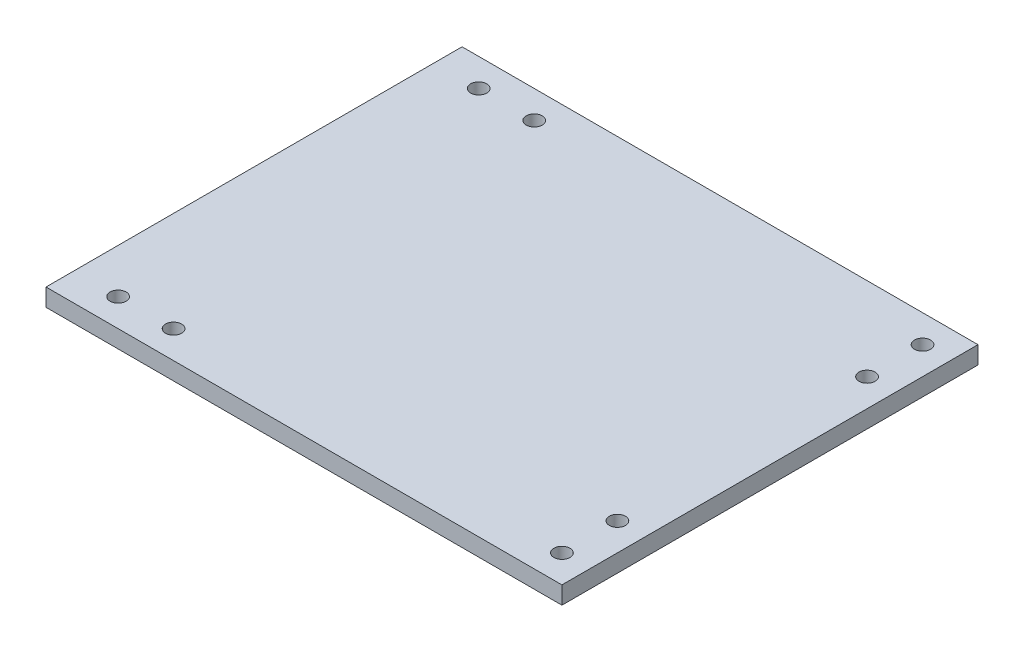
ISO-10303-21;
HEADER;
FILE_DESCRIPTION(('STEP AP214'),'2;1');
FILE_NAME('part.step','',(''),(''),'','','');
FILE_SCHEMA(('AUTOMOTIVE_DESIGN { 1 0 10303 214 1 1 1 1 }'));
ENDSEC;
DATA;
#1=APPLICATION_CONTEXT('core data for automotive mechanical design processes');
#2=APPLICATION_PROTOCOL_DEFINITION('international standard','automotive_design',2000,#1);
#3=PRODUCT_CONTEXT('',#1,'mechanical');
#4=PRODUCT('Part','Part','',(#3));
#5=PRODUCT_RELATED_PRODUCT_CATEGORY('part','',(#4));
#6=PRODUCT_DEFINITION_FORMATION('','',#4);
#7=PRODUCT_DEFINITION_CONTEXT('part definition',#1,'design');
#8=PRODUCT_DEFINITION('design','',#6,#7);
#9=PRODUCT_DEFINITION_SHAPE('','',#8);
#10=(LENGTH_UNIT() NAMED_UNIT(*) SI_UNIT(.MILLI.,.METRE.));
#11=(NAMED_UNIT(*) PLANE_ANGLE_UNIT() SI_UNIT($,.RADIAN.));
#12=(NAMED_UNIT(*) SI_UNIT($,.STERADIAN.) SOLID_ANGLE_UNIT());
#13=UNCERTAINTY_MEASURE_WITH_UNIT(LENGTH_MEASURE(1.E-05),#10,'distance_accuracy_value','');
#14=(GEOMETRIC_REPRESENTATION_CONTEXT(3) GLOBAL_UNCERTAINTY_ASSIGNED_CONTEXT((#13)) GLOBAL_UNIT_ASSIGNED_CONTEXT((#10,
#11,#12)) REPRESENTATION_CONTEXT('',''));
#15=CARTESIAN_POINT('',(0.,0.,0.));
#16=DIRECTION('',(0.,0.,1.));
#17=DIRECTION('',(1.,0.,0.));
#18=AXIS2_PLACEMENT_3D('',#15,#16,#17);
#19=CARTESIAN_POINT('',(-3.,3.175,0.));
#20=DIRECTION('',(0.,-1.,0.));
#21=DIRECTION('',(0.,0.,-1.));
#22=AXIS2_PLACEMENT_3D('',#19,#20,#21);
#23=PLANE('',#22);
#24=CARTESIAN_POINT('',(5.,3.175,32.5));
#25=DIRECTION('',(0.,1.,0.));
#26=DIRECTION('',(0.,0.,1.));
#27=AXIS2_PLACEMENT_3D('',#24,#25,#26);
#28=CIRCLE('',#27,1.45);
#29=CARTESIAN_POINT('',(5.,3.175,33.95));
#30=VERTEX_POINT('',#29);
#31=EDGE_CURVE('E108',#30,#30,#28,.T.);
#32=ORIENTED_EDGE('',*,*,#31,.F.);
#33=EDGE_LOOP('',(#32));
#34=FACE_BOUND('',#33,.T.);
#35=CARTESIAN_POINT('',(85.,3.175,32.5));
#36=DIRECTION('',(0.,1.,0.));
#37=DIRECTION('',(0.,0.,1.));
#38=AXIS2_PLACEMENT_3D('',#35,#36,#37);
#39=CIRCLE('',#38,1.45);
#40=CARTESIAN_POINT('',(85.,3.175,33.95));
#41=VERTEX_POINT('',#40);
#42=EDGE_CURVE('E80',#41,#41,#39,.T.);
#43=ORIENTED_EDGE('',*,*,#42,.F.);
#44=EDGE_LOOP('',(#43));
#45=FACE_BOUND('',#44,.T.);
#46=DIRECTION('',(0.,0.,1.));
#47=VECTOR('',#46,1.);
#48=CARTESIAN_POINT('',(-3.,3.175,37.5));
#49=LINE('',#48,#47);
#50=CARTESIAN_POINT('',(-3.,3.175,-37.5));
#51=VERTEX_POINT('',#50);
#52=CARTESIAN_POINT('',(-3.,3.175,37.5));
#53=VERTEX_POINT('',#52);
#54=EDGE_CURVE('E66',#51,#53,#49,.T.);
#55=ORIENTED_EDGE('',*,*,#54,.T.);
#56=DIRECTION('',(1.,0.,0.));
#57=VECTOR('',#56,1.);
#58=CARTESIAN_POINT('',(-3.,3.175,37.5));
#59=LINE('',#58,#57);
#60=CARTESIAN_POINT('',(90.,3.175,37.5));
#61=VERTEX_POINT('',#60);
#62=EDGE_CURVE('E48',#53,#61,#59,.T.);
#63=ORIENTED_EDGE('',*,*,#62,.T.);
#64=DIRECTION('',(0.,0.,-1.));
#65=VECTOR('',#64,1.);
#66=CARTESIAN_POINT('',(90.,3.175,37.5));
#67=LINE('',#66,#65);
#68=CARTESIAN_POINT('',(90.,3.175,-37.5));
#69=VERTEX_POINT('',#68);
#70=EDGE_CURVE('E127',#61,#69,#67,.T.);
#71=ORIENTED_EDGE('',*,*,#70,.T.);
#72=DIRECTION('',(1.,0.,0.));
#73=VECTOR('',#72,1.);
#74=CARTESIAN_POINT('',(-3.,3.175,-37.5));
#75=LINE('',#74,#73);
#76=EDGE_CURVE('E87',#51,#69,#75,.T.);
#77=ORIENTED_EDGE('',*,*,#76,.F.);
#78=EDGE_LOOP('',(#55,#63,#71,#77));
#79=FACE_BOUND('',#78,.T.);
#80=CARTESIAN_POINT('',(85.,3.175,22.5));
#81=DIRECTION('',(0.,1.,0.));
#82=DIRECTION('',(0.,0.,1.));
#83=AXIS2_PLACEMENT_3D('',#80,#81,#82);
#84=CIRCLE('',#83,1.45);
#85=CARTESIAN_POINT('',(85.,3.175,23.95));
#86=VERTEX_POINT('',#85);
#87=EDGE_CURVE('E114',#86,#86,#84,.T.);
#88=ORIENTED_EDGE('',*,*,#87,.F.);
#89=EDGE_LOOP('',(#88));
#90=FACE_BOUND('',#89,.T.);
#91=CARTESIAN_POINT('',(15.,3.175,32.5));
#92=DIRECTION('',(0.,1.,0.));
#93=DIRECTION('',(0.,0.,1.));
#94=AXIS2_PLACEMENT_3D('',#91,#92,#93);
#95=CIRCLE('',#94,1.45);
#96=CARTESIAN_POINT('',(15.,3.175,33.95));
#97=VERTEX_POINT('',#96);
#98=EDGE_CURVE('E102',#97,#97,#95,.T.);
#99=ORIENTED_EDGE('',*,*,#98,.F.);
#100=EDGE_LOOP('',(#99));
#101=FACE_BOUND('',#100,.T.);
#102=CARTESIAN_POINT('',(15.,3.175,-32.5));
#103=DIRECTION('',(0.,-1.,0.));
#104=DIRECTION('',(0.,0.,-1.));
#105=AXIS2_PLACEMENT_3D('',#102,#103,#104);
#106=CIRCLE('',#105,1.45);
#107=CARTESIAN_POINT('',(15.,3.175,-33.95));
#108=VERTEX_POINT('',#107);
#109=EDGE_CURVE('E147',#108,#108,#106,.T.);
#110=ORIENTED_EDGE('',*,*,#109,.T.);
#111=EDGE_LOOP('',(#110));
#112=FACE_BOUND('',#111,.T.);
#113=CARTESIAN_POINT('',(5.,3.175,-32.5));
#114=DIRECTION('',(0.,-1.,0.));
#115=DIRECTION('',(0.,0.,-1.));
#116=AXIS2_PLACEMENT_3D('',#113,#114,#115);
#117=CIRCLE('',#116,1.45);
#118=CARTESIAN_POINT('',(5.,3.175,-33.95));
#119=VERTEX_POINT('',#118);
#120=EDGE_CURVE('E151',#119,#119,#117,.T.);
#121=ORIENTED_EDGE('',*,*,#120,.T.);
#122=EDGE_LOOP('',(#121));
#123=FACE_BOUND('',#122,.T.);
#124=CARTESIAN_POINT('',(85.,3.175,-22.5));
#125=DIRECTION('',(0.,-1.,0.));
#126=DIRECTION('',(0.,0.,-1.));
#127=AXIS2_PLACEMENT_3D('',#124,#125,#126);
#128=CIRCLE('',#127,1.45);
#129=CARTESIAN_POINT('',(85.,3.175,-23.95));
#130=VERTEX_POINT('',#129);
#131=EDGE_CURVE('E155',#130,#130,#128,.T.);
#132=ORIENTED_EDGE('',*,*,#131,.T.);
#133=EDGE_LOOP('',(#132));
#134=FACE_BOUND('',#133,.T.);
#135=CARTESIAN_POINT('',(85.,3.175,-32.5));
#136=DIRECTION('',(0.,-1.,0.));
#137=DIRECTION('',(0.,0.,-1.));
#138=AXIS2_PLACEMENT_3D('',#135,#136,#137);
#139=CIRCLE('',#138,1.45);
#140=CARTESIAN_POINT('',(85.,3.175,-33.95));
#141=VERTEX_POINT('',#140);
#142=EDGE_CURVE('E92',#141,#141,#139,.T.);
#143=ORIENTED_EDGE('',*,*,#142,.T.);
#144=EDGE_LOOP('',(#143));
#145=FACE_BOUND('',#144,.T.);
#146=ADVANCED_FACE('F31',(#34,#45,#79,#90,#101,#112,#123,#134,#145),#23,.F.);
#147=CARTESIAN_POINT('',(-3.,0.,0.));
#148=DIRECTION('',(0.,-1.,0.));
#149=DIRECTION('',(0.,0.,-1.));
#150=AXIS2_PLACEMENT_3D('',#147,#148,#149);
#151=PLANE('',#150);
#152=CARTESIAN_POINT('',(5.,0.,32.5));
#153=DIRECTION('',(0.,1.,0.));
#154=DIRECTION('',(0.,0.,1.));
#155=AXIS2_PLACEMENT_3D('',#152,#153,#154);
#156=CIRCLE('',#155,1.45);
#157=CARTESIAN_POINT('',(5.,0.,33.95));
#158=VERTEX_POINT('',#157);
#159=EDGE_CURVE('E105',#158,#158,#156,.T.);
#160=ORIENTED_EDGE('',*,*,#159,.T.);
#161=EDGE_LOOP('',(#160));
#162=FACE_BOUND('',#161,.T.);
#163=CARTESIAN_POINT('',(85.,0.,32.5));
#164=DIRECTION('',(0.,1.,0.));
#165=DIRECTION('',(0.,0.,1.));
#166=AXIS2_PLACEMENT_3D('',#163,#164,#165);
#167=CIRCLE('',#166,1.45);
#168=CARTESIAN_POINT('',(85.,0.,33.95));
#169=VERTEX_POINT('',#168);
#170=EDGE_CURVE('E117',#169,#169,#167,.T.);
#171=ORIENTED_EDGE('',*,*,#170,.T.);
#172=EDGE_LOOP('',(#171));
#173=FACE_BOUND('',#172,.T.);
#174=DIRECTION('',(0.,0.,1.));
#175=VECTOR('',#174,1.);
#176=CARTESIAN_POINT('',(-3.,0.,37.5));
#177=LINE('',#176,#175);
#178=CARTESIAN_POINT('',(-3.,0.,-37.5));
#179=VERTEX_POINT('',#178);
#180=CARTESIAN_POINT('',(-3.,0.,37.5));
#181=VERTEX_POINT('',#180);
#182=EDGE_CURVE('E75',#179,#181,#177,.T.);
#183=ORIENTED_EDGE('',*,*,#182,.F.);
#184=DIRECTION('',(1.,0.,0.));
#185=VECTOR('',#184,1.);
#186=CARTESIAN_POINT('',(-3.,0.,-37.5));
#187=LINE('',#186,#185);
#188=CARTESIAN_POINT('',(90.,0.,-37.5));
#189=VERTEX_POINT('',#188);
#190=EDGE_CURVE('E79',#179,#189,#187,.T.);
#191=ORIENTED_EDGE('',*,*,#190,.T.);
#192=DIRECTION('',(0.,0.,-1.));
#193=VECTOR('',#192,1.);
#194=CARTESIAN_POINT('',(90.,0.,37.5));
#195=LINE('',#194,#193);
#196=CARTESIAN_POINT('',(90.,0.,37.5));
#197=VERTEX_POINT('',#196);
#198=EDGE_CURVE('E125',#197,#189,#195,.T.);
#199=ORIENTED_EDGE('',*,*,#198,.F.);
#200=DIRECTION('',(1.,0.,0.));
#201=VECTOR('',#200,1.);
#202=CARTESIAN_POINT('',(-3.,0.,37.5));
#203=LINE('',#202,#201);
#204=EDGE_CURVE('E59',#181,#197,#203,.T.);
#205=ORIENTED_EDGE('',*,*,#204,.F.);
#206=EDGE_LOOP('',(#183,#191,#199,#205));
#207=FACE_BOUND('',#206,.T.);
#208=CARTESIAN_POINT('',(85.,0.,22.5));
#209=DIRECTION('',(0.,1.,0.));
#210=DIRECTION('',(0.,0.,1.));
#211=AXIS2_PLACEMENT_3D('',#208,#209,#210);
#212=CIRCLE('',#211,1.45);
#213=CARTESIAN_POINT('',(85.,0.,23.95));
#214=VERTEX_POINT('',#213);
#215=EDGE_CURVE('E111',#214,#214,#212,.T.);
#216=ORIENTED_EDGE('',*,*,#215,.T.);
#217=EDGE_LOOP('',(#216));
#218=FACE_BOUND('',#217,.T.);
#219=CARTESIAN_POINT('',(15.,0.,32.5));
#220=DIRECTION('',(0.,1.,0.));
#221=DIRECTION('',(0.,0.,1.));
#222=AXIS2_PLACEMENT_3D('',#219,#220,#221);
#223=CIRCLE('',#222,1.45);
#224=CARTESIAN_POINT('',(15.,0.,33.95));
#225=VERTEX_POINT('',#224);
#226=EDGE_CURVE('E101',#225,#225,#223,.T.);
#227=ORIENTED_EDGE('',*,*,#226,.T.);
#228=EDGE_LOOP('',(#227));
#229=FACE_BOUND('',#228,.T.);
#230=CARTESIAN_POINT('',(15.,0.,-32.5));
#231=DIRECTION('',(0.,-1.,0.));
#232=DIRECTION('',(0.,0.,-1.));
#233=AXIS2_PLACEMENT_3D('',#230,#231,#232);
#234=CIRCLE('',#233,1.45);
#235=CARTESIAN_POINT('',(15.,0.,-33.95));
#236=VERTEX_POINT('',#235);
#237=EDGE_CURVE('E175',#236,#236,#234,.T.);
#238=ORIENTED_EDGE('',*,*,#237,.F.);
#239=EDGE_LOOP('',(#238));
#240=FACE_BOUND('',#239,.T.);
#241=CARTESIAN_POINT('',(5.,0.,-32.5));
#242=DIRECTION('',(0.,-1.,0.));
#243=DIRECTION('',(0.,0.,-1.));
#244=AXIS2_PLACEMENT_3D('',#241,#242,#243);
#245=CIRCLE('',#244,1.45);
#246=CARTESIAN_POINT('',(5.,0.,-33.95));
#247=VERTEX_POINT('',#246);
#248=EDGE_CURVE('E171',#247,#247,#245,.T.);
#249=ORIENTED_EDGE('',*,*,#248,.F.);
#250=EDGE_LOOP('',(#249));
#251=FACE_BOUND('',#250,.T.);
#252=CARTESIAN_POINT('',(85.,0.,-22.5));
#253=DIRECTION('',(0.,-1.,0.));
#254=DIRECTION('',(0.,0.,-1.));
#255=AXIS2_PLACEMENT_3D('',#252,#253,#254);
#256=CIRCLE('',#255,1.45);
#257=CARTESIAN_POINT('',(85.,0.,-23.95));
#258=VERTEX_POINT('',#257);
#259=EDGE_CURVE('E166',#258,#258,#256,.T.);
#260=ORIENTED_EDGE('',*,*,#259,.F.);
#261=EDGE_LOOP('',(#260));
#262=FACE_BOUND('',#261,.T.);
#263=CARTESIAN_POINT('',(85.,0.,-32.5));
#264=DIRECTION('',(0.,-1.,0.));
#265=DIRECTION('',(0.,0.,-1.));
#266=AXIS2_PLACEMENT_3D('',#263,#264,#265);
#267=CIRCLE('',#266,1.45);
#268=CARTESIAN_POINT('',(85.,0.,-33.95));
#269=VERTEX_POINT('',#268);
#270=EDGE_CURVE('E96',#269,#269,#267,.T.);
#271=ORIENTED_EDGE('',*,*,#270,.F.);
#272=EDGE_LOOP('',(#271));
#273=FACE_BOUND('',#272,.T.);
#274=ADVANCED_FACE('F76',(#162,#173,#207,#218,#229,#240,#251,#262,#273),#151,.T.);
#275=CARTESIAN_POINT('',(-3.,3.175,37.5));
#276=DIRECTION('',(1.,0.,0.));
#277=DIRECTION('',(0.,0.,-1.));
#278=AXIS2_PLACEMENT_3D('',#275,#276,#277);
#279=PLANE('',#278);
#280=ORIENTED_EDGE('',*,*,#182,.T.);
#281=DIRECTION('',(0.,-1.,0.));
#282=VECTOR('',#281,1.);
#283=CARTESIAN_POINT('',(-3.,3.175,37.5));
#284=LINE('',#283,#282);
#285=EDGE_CURVE('E11',#53,#181,#284,.T.);
#286=ORIENTED_EDGE('',*,*,#285,.F.);
#287=ORIENTED_EDGE('',*,*,#54,.F.);
#288=DIRECTION('',(0.,-1.,0.));
#289=VECTOR('',#288,1.);
#290=CARTESIAN_POINT('',(-3.,3.175,-37.5));
#291=LINE('',#290,#289);
#292=EDGE_CURVE('E82',#51,#179,#291,.T.);
#293=ORIENTED_EDGE('',*,*,#292,.T.);
#294=EDGE_LOOP('',(#280,#286,#287,#293));
#295=FACE_BOUND('',#294,.T.);
#296=ADVANCED_FACE('F33',(#295),#279,.F.);
#297=CARTESIAN_POINT('',(-3.,3.175,37.5));
#298=DIRECTION('',(0.,0.,-1.));
#299=DIRECTION('',(-1.,0.,0.));
#300=AXIS2_PLACEMENT_3D('',#297,#298,#299);
#301=PLANE('',#300);
#302=ORIENTED_EDGE('',*,*,#204,.T.);
#303=DIRECTION('',(0.,-1.,0.));
#304=VECTOR('',#303,1.);
#305=CARTESIAN_POINT('',(90.,3.175,37.5));
#306=LINE('',#305,#304);
#307=EDGE_CURVE('E40',#61,#197,#306,.T.);
#308=ORIENTED_EDGE('',*,*,#307,.F.);
#309=ORIENTED_EDGE('',*,*,#62,.F.);
#310=ORIENTED_EDGE('',*,*,#285,.T.);
#311=EDGE_LOOP('',(#302,#308,#309,#310));
#312=FACE_BOUND('',#311,.T.);
#313=ADVANCED_FACE('F135',(#312),#301,.F.);
#314=CARTESIAN_POINT('',(90.,3.175,37.5));
#315=DIRECTION('',(-1.,0.,0.));
#316=DIRECTION('',(0.,0.,1.));
#317=AXIS2_PLACEMENT_3D('',#314,#315,#316);
#318=PLANE('',#317);
#319=ORIENTED_EDGE('',*,*,#198,.T.);
#320=DIRECTION('',(0.,-1.,0.));
#321=VECTOR('',#320,1.);
#322=CARTESIAN_POINT('',(90.,3.175,-37.5));
#323=LINE('',#322,#321);
#324=EDGE_CURVE('E86',#69,#189,#323,.T.);
#325=ORIENTED_EDGE('',*,*,#324,.F.);
#326=ORIENTED_EDGE('',*,*,#70,.F.);
#327=ORIENTED_EDGE('',*,*,#307,.T.);
#328=EDGE_LOOP('',(#319,#325,#326,#327));
#329=FACE_BOUND('',#328,.T.);
#330=ADVANCED_FACE('F133',(#329),#318,.F.);
#331=CARTESIAN_POINT('',(85.,3.175,32.5));
#332=DIRECTION('',(0.,-1.,0.));
#333=DIRECTION('',(0.,0.,-1.));
#334=AXIS2_PLACEMENT_3D('',#331,#332,#333);
#335=CYLINDRICAL_SURFACE('',#334,1.45);
#336=ORIENTED_EDGE('',*,*,#42,.T.);
#337=EDGE_LOOP('',(#336));
#338=FACE_BOUND('',#337,.T.);
#339=ORIENTED_EDGE('',*,*,#170,.F.);
#340=EDGE_LOOP('',(#339));
#341=FACE_BOUND('',#340,.T.);
#342=ADVANCED_FACE('F214',(#338,#341),#335,.F.);
#343=CARTESIAN_POINT('',(85.,3.175,22.5));
#344=DIRECTION('',(0.,-1.,0.));
#345=DIRECTION('',(0.,0.,-1.));
#346=AXIS2_PLACEMENT_3D('',#343,#344,#345);
#347=CYLINDRICAL_SURFACE('',#346,1.45);
#348=ORIENTED_EDGE('',*,*,#87,.T.);
#349=EDGE_LOOP('',(#348));
#350=FACE_BOUND('',#349,.T.);
#351=ORIENTED_EDGE('',*,*,#215,.F.);
#352=EDGE_LOOP('',(#351));
#353=FACE_BOUND('',#352,.T.);
#354=ADVANCED_FACE('F210',(#350,#353),#347,.F.);
#355=CARTESIAN_POINT('',(5.,3.175,32.5));
#356=DIRECTION('',(0.,-1.,0.));
#357=DIRECTION('',(0.,0.,-1.));
#358=AXIS2_PLACEMENT_3D('',#355,#356,#357);
#359=CYLINDRICAL_SURFACE('',#358,1.45);
#360=ORIENTED_EDGE('',*,*,#31,.T.);
#361=EDGE_LOOP('',(#360));
#362=FACE_BOUND('',#361,.T.);
#363=ORIENTED_EDGE('',*,*,#159,.F.);
#364=EDGE_LOOP('',(#363));
#365=FACE_BOUND('',#364,.T.);
#366=ADVANCED_FACE('F206',(#362,#365),#359,.F.);
#367=CARTESIAN_POINT('',(15.,3.175,32.5));
#368=DIRECTION('',(0.,-1.,0.));
#369=DIRECTION('',(0.,0.,-1.));
#370=AXIS2_PLACEMENT_3D('',#367,#368,#369);
#371=CYLINDRICAL_SURFACE('',#370,1.45);
#372=ORIENTED_EDGE('',*,*,#98,.T.);
#373=EDGE_LOOP('',(#372));
#374=FACE_BOUND('',#373,.T.);
#375=ORIENTED_EDGE('',*,*,#226,.F.);
#376=EDGE_LOOP('',(#375));
#377=FACE_BOUND('',#376,.T.);
#378=ADVANCED_FACE('F203',(#374,#377),#371,.F.);
#379=CARTESIAN_POINT('',(-3.,3.175,-37.5));
#380=DIRECTION('',(0.,0.,-1.));
#381=DIRECTION('',(-1.,0.,0.));
#382=AXIS2_PLACEMENT_3D('',#379,#380,#381);
#383=PLANE('',#382);
#384=ORIENTED_EDGE('',*,*,#190,.F.);
#385=ORIENTED_EDGE('',*,*,#292,.F.);
#386=ORIENTED_EDGE('',*,*,#76,.T.);
#387=ORIENTED_EDGE('',*,*,#324,.T.);
#388=EDGE_LOOP('',(#384,#385,#386,#387));
#389=FACE_BOUND('',#388,.T.);
#390=ADVANCED_FACE('F90',(#389),#383,.T.);
#391=CARTESIAN_POINT('',(85.,3.175,-32.5));
#392=DIRECTION('',(0.,-1.,0.));
#393=DIRECTION('',(0.,0.,-1.));
#394=AXIS2_PLACEMENT_3D('',#391,#392,#393);
#395=CYLINDRICAL_SURFACE('',#394,1.45);
#396=ORIENTED_EDGE('',*,*,#142,.F.);
#397=EDGE_LOOP('',(#396));
#398=FACE_BOUND('',#397,.T.);
#399=ORIENTED_EDGE('',*,*,#270,.T.);
#400=EDGE_LOOP('',(#399));
#401=FACE_BOUND('',#400,.T.);
#402=ADVANCED_FACE('F158',(#398,#401),#395,.F.);
#403=CARTESIAN_POINT('',(85.,3.175,-22.5));
#404=DIRECTION('',(0.,-1.,0.));
#405=DIRECTION('',(0.,0.,-1.));
#406=AXIS2_PLACEMENT_3D('',#403,#404,#405);
#407=CYLINDRICAL_SURFACE('',#406,1.45);
#408=ORIENTED_EDGE('',*,*,#131,.F.);
#409=EDGE_LOOP('',(#408));
#410=FACE_BOUND('',#409,.T.);
#411=ORIENTED_EDGE('',*,*,#259,.T.);
#412=EDGE_LOOP('',(#411));
#413=FACE_BOUND('',#412,.T.);
#414=ADVANCED_FACE('F161',(#410,#413),#407,.F.);
#415=CARTESIAN_POINT('',(5.,3.175,-32.5));
#416=DIRECTION('',(0.,-1.,0.));
#417=DIRECTION('',(0.,0.,-1.));
#418=AXIS2_PLACEMENT_3D('',#415,#416,#417);
#419=CYLINDRICAL_SURFACE('',#418,1.45);
#420=ORIENTED_EDGE('',*,*,#120,.F.);
#421=EDGE_LOOP('',(#420));
#422=FACE_BOUND('',#421,.T.);
#423=ORIENTED_EDGE('',*,*,#248,.T.);
#424=EDGE_LOOP('',(#423));
#425=FACE_BOUND('',#424,.T.);
#426=ADVANCED_FACE('F191',(#422,#425),#419,.F.);
#427=CARTESIAN_POINT('',(15.,3.175,-32.5));
#428=DIRECTION('',(0.,-1.,0.));
#429=DIRECTION('',(0.,0.,-1.));
#430=AXIS2_PLACEMENT_3D('',#427,#428,#429);
#431=CYLINDRICAL_SURFACE('',#430,1.45);
#432=ORIENTED_EDGE('',*,*,#109,.F.);
#433=EDGE_LOOP('',(#432));
#434=FACE_BOUND('',#433,.T.);
#435=ORIENTED_EDGE('',*,*,#237,.T.);
#436=EDGE_LOOP('',(#435));
#437=FACE_BOUND('',#436,.T.);
#438=ADVANCED_FACE('F180',(#434,#437),#431,.F.);
#439=CLOSED_SHELL('',(#146,#274,#296,#313,#330,#342,#354,#366,#378,#390,#402,#414,#426,#438));
#440=MANIFOLD_SOLID_BREP('B2',#439);
#441=ADVANCED_BREP_SHAPE_REPRESENTATION('',(#18,#440),#14);
#442=SHAPE_DEFINITION_REPRESENTATION(#9,#441);
ENDSEC;
END-ISO-10303-21;
